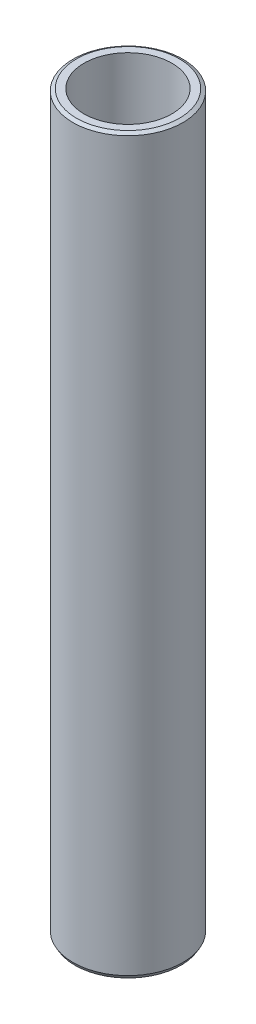
ISO-10303-21;
HEADER;
FILE_DESCRIPTION(('STEP AP214'),'2;1');
FILE_NAME('part.step','',(''),(''),'','','');
FILE_SCHEMA(('AUTOMOTIVE_DESIGN { 1 0 10303 214 1 1 1 1 }'));
ENDSEC;
DATA;
#1=APPLICATION_CONTEXT('core data for automotive mechanical design processes');
#2=APPLICATION_PROTOCOL_DEFINITION('international standard','automotive_design',2000,#1);
#3=PRODUCT_CONTEXT('',#1,'mechanical');
#4=PRODUCT('Part','Part','',(#3));
#5=PRODUCT_RELATED_PRODUCT_CATEGORY('part','',(#4));
#6=PRODUCT_DEFINITION_FORMATION('','',#4);
#7=PRODUCT_DEFINITION_CONTEXT('part definition',#1,'design');
#8=PRODUCT_DEFINITION('design','',#6,#7);
#9=PRODUCT_DEFINITION_SHAPE('','',#8);
#10=(LENGTH_UNIT() NAMED_UNIT(*) SI_UNIT(.MILLI.,.METRE.));
#11=(NAMED_UNIT(*) PLANE_ANGLE_UNIT() SI_UNIT($,.RADIAN.));
#12=(NAMED_UNIT(*) SI_UNIT($,.STERADIAN.) SOLID_ANGLE_UNIT());
#13=UNCERTAINTY_MEASURE_WITH_UNIT(LENGTH_MEASURE(1.E-05),#10,'distance_accuracy_value','');
#14=(GEOMETRIC_REPRESENTATION_CONTEXT(3) GLOBAL_UNCERTAINTY_ASSIGNED_CONTEXT((#13)) GLOBAL_UNIT_ASSIGNED_CONTEXT((#10,
#11,#12)) REPRESENTATION_CONTEXT('',''));
#15=CARTESIAN_POINT('',(0.,0.,0.));
#16=DIRECTION('',(0.,0.,1.));
#17=DIRECTION('',(1.,0.,0.));
#18=AXIS2_PLACEMENT_3D('',#15,#16,#17);
#19=CARTESIAN_POINT('',(0.,600.,0.));
#20=DIRECTION('',(0.,-1.,0.));
#21=DIRECTION('',(0.,0.,-1.));
#22=AXIS2_PLACEMENT_3D('',#19,#20,#21);
#23=CYLINDRICAL_SURFACE('',#22,45.);
#24=CARTESIAN_POINT('',(0.,598.346489207904,0.));
#25=DIRECTION('',(0.,1.,0.));
#26=DIRECTION('',(0.,0.,1.));
#27=AXIS2_PLACEMENT_3D('',#24,#25,#26);
#28=CIRCLE('',#27,45.);
#29=CARTESIAN_POINT('',(0.,598.346489207904,45.));
#30=VERTEX_POINT('',#29);
#31=EDGE_CURVE('E50',#30,#30,#28,.F.);
#32=ORIENTED_EDGE('',*,*,#31,.T.);
#33=EDGE_LOOP('',(#32));
#34=FACE_BOUND('',#33,.T.);
#35=CARTESIAN_POINT('',(0.,2.86396470277273,0.));
#36=DIRECTION('',(0.,1.,0.));
#37=DIRECTION('',(0.,0.,1.));
#38=AXIS2_PLACEMENT_3D('',#35,#36,#37);
#39=CIRCLE('',#38,45.);
#40=CARTESIAN_POINT('',(0.,2.86396470277273,45.));
#41=VERTEX_POINT('',#40);
#42=EDGE_CURVE('E51',#41,#41,#39,.T.);
#43=ORIENTED_EDGE('',*,*,#42,.T.);
#44=EDGE_LOOP('',(#43));
#45=FACE_BOUND('',#44,.T.);
#46=ADVANCED_FACE('F39',(#34,#45),#23,.T.);
#47=CARTESIAN_POINT('',(0.,600.,0.));
#48=DIRECTION('',(0.,1.,0.));
#49=DIRECTION('',(0.,0.,1.));
#50=AXIS2_PLACEMENT_3D('',#47,#48,#49);
#51=PLANE('',#50);
#52=CARTESIAN_POINT('',(0.,600.,0.));
#53=DIRECTION('',(0.,1.,0.));
#54=DIRECTION('',(0.,0.,1.));
#55=AXIS2_PLACEMENT_3D('',#52,#53,#54);
#56=CIRCLE('',#55,42.136035297227);
#57=CARTESIAN_POINT('',(0.,600.,42.136035297227));
#58=VERTEX_POINT('',#57);
#59=EDGE_CURVE('E54',#58,#58,#56,.T.);
#60=ORIENTED_EDGE('',*,*,#59,.T.);
#61=EDGE_LOOP('',(#60));
#62=FACE_BOUND('',#61,.T.);
#63=CARTESIAN_POINT('',(0.,600.,0.));
#64=DIRECTION('',(0.,1.,0.));
#65=DIRECTION('',(0.,0.,1.));
#66=AXIS2_PLACEMENT_3D('',#63,#64,#65);
#67=CIRCLE('',#66,35.989088653985);
#68=CARTESIAN_POINT('',(0.,600.,35.989088653985));
#69=VERTEX_POINT('',#68);
#70=EDGE_CURVE('E58',#69,#69,#67,.T.);
#71=ORIENTED_EDGE('',*,*,#70,.F.);
#72=EDGE_LOOP('',(#71));
#73=FACE_BOUND('',#72,.T.);
#74=ADVANCED_FACE('F69',(#62,#73),#51,.T.);
#75=CARTESIAN_POINT('',(0.,0.,0.));
#76=DIRECTION('',(0.,1.,0.));
#77=DIRECTION('',(0.,0.,1.));
#78=AXIS2_PLACEMENT_3D('',#75,#76,#77);
#79=PLANE('',#78);
#80=CARTESIAN_POINT('',(0.,0.,0.));
#81=DIRECTION('',(0.,1.,0.));
#82=DIRECTION('',(0.,0.,1.));
#83=AXIS2_PLACEMENT_3D('',#80,#81,#82);
#84=CIRCLE('',#83,43.3464892079046);
#85=CARTESIAN_POINT('',(0.,0.,43.3464892079046));
#86=VERTEX_POINT('',#85);
#87=EDGE_CURVE('E10',#86,#86,#84,.F.);
#88=ORIENTED_EDGE('',*,*,#87,.T.);
#89=EDGE_LOOP('',(#88));
#90=FACE_BOUND('',#89,.T.);
#91=CARTESIAN_POINT('',(0.,0.,0.));
#92=DIRECTION('',(0.,1.,0.));
#93=DIRECTION('',(0.,0.,1.));
#94=AXIS2_PLACEMENT_3D('',#91,#92,#93);
#95=CIRCLE('',#94,35.989088653985);
#96=CARTESIAN_POINT('',(0.,0.,35.989088653985));
#97=VERTEX_POINT('',#96);
#98=EDGE_CURVE('E63',#97,#97,#95,.T.);
#99=ORIENTED_EDGE('',*,*,#98,.T.);
#100=EDGE_LOOP('',(#99));
#101=FACE_BOUND('',#100,.T.);
#102=ADVANCED_FACE('F75',(#90,#101),#79,.F.);
#103=CARTESIAN_POINT('',(0.,600.,0.));
#104=DIRECTION('',(0.,-1.,0.));
#105=DIRECTION('',(0.,0.,-1.));
#106=AXIS2_PLACEMENT_3D('',#103,#104,#105);
#107=CYLINDRICAL_SURFACE('',#106,35.989088653985);
#108=ORIENTED_EDGE('',*,*,#70,.T.);
#109=EDGE_LOOP('',(#108));
#110=FACE_BOUND('',#109,.T.);
#111=ORIENTED_EDGE('',*,*,#98,.F.);
#112=EDGE_LOOP('',(#111));
#113=FACE_BOUND('',#112,.T.);
#114=ADVANCED_FACE('F70',(#110,#113),#107,.F.);
#115=CARTESIAN_POINT('',(0.,600.,0.));
#116=DIRECTION('',(0.,-1.,0.));
#117=DIRECTION('',(0.,0.,-1.));
#118=AXIS2_PLACEMENT_3D('',#115,#116,#117);
#119=CONICAL_SURFACE('',#118,42.136035297227,1.04719755119659);
#120=ORIENTED_EDGE('',*,*,#31,.F.);
#121=EDGE_LOOP('',(#120));
#122=FACE_BOUND('',#121,.T.);
#123=ORIENTED_EDGE('',*,*,#59,.F.);
#124=EDGE_LOOP('',(#123));
#125=FACE_BOUND('',#124,.T.);
#126=ADVANCED_FACE('F81',(#122,#125),#119,.T.);
#127=CARTESIAN_POINT('',(0.,2.86396470277273,0.));
#128=DIRECTION('',(0.,1.,0.));
#129=DIRECTION('',(0.,0.,1.));
#130=AXIS2_PLACEMENT_3D('',#127,#128,#129);
#131=CONICAL_SURFACE('',#130,45.,0.523598775598303);
#132=ORIENTED_EDGE('',*,*,#87,.F.);
#133=EDGE_LOOP('',(#132));
#134=FACE_BOUND('',#133,.T.);
#135=ORIENTED_EDGE('',*,*,#42,.F.);
#136=EDGE_LOOP('',(#135));
#137=FACE_BOUND('',#136,.T.);
#138=ADVANCED_FACE('F45',(#134,#137),#131,.T.);
#139=CLOSED_SHELL('',(#46,#74,#102,#114,#126,#138));
#140=MANIFOLD_SOLID_BREP('B2',#139);
#141=ADVANCED_BREP_SHAPE_REPRESENTATION('',(#18,#140),#14);
#142=SHAPE_DEFINITION_REPRESENTATION(#9,#141);
ENDSEC;
END-ISO-10303-21;
